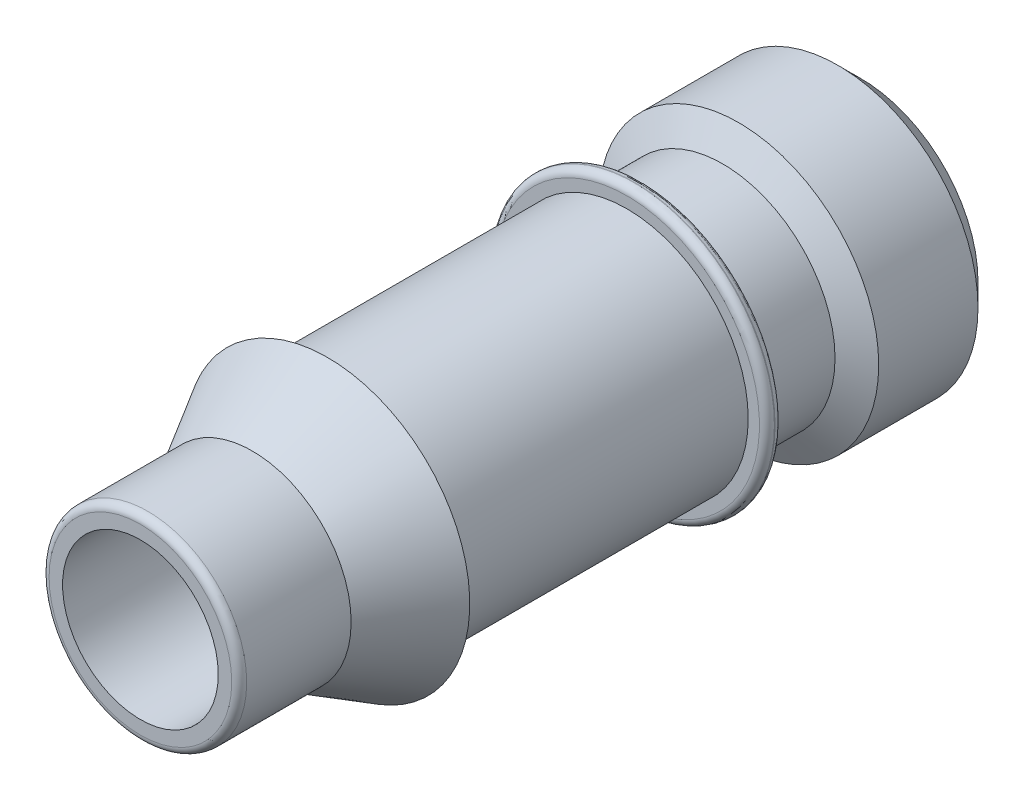
ISO-10303-21;
HEADER;
FILE_DESCRIPTION(('STEP AP214'),'2;1');
FILE_NAME('part.step','',(''),(''),'','','');
FILE_SCHEMA(('AUTOMOTIVE_DESIGN { 1 0 10303 214 1 1 1 1 }'));
ENDSEC;
DATA;
#1=APPLICATION_CONTEXT('core data for automotive mechanical design processes');
#2=APPLICATION_PROTOCOL_DEFINITION('international standard','automotive_design',2000,#1);
#3=PRODUCT_CONTEXT('',#1,'mechanical');
#4=PRODUCT('Part','Part','',(#3));
#5=PRODUCT_RELATED_PRODUCT_CATEGORY('part','',(#4));
#6=PRODUCT_DEFINITION_FORMATION('','',#4);
#7=PRODUCT_DEFINITION_CONTEXT('part definition',#1,'design');
#8=PRODUCT_DEFINITION('design','',#6,#7);
#9=PRODUCT_DEFINITION_SHAPE('','',#8);
#10=(LENGTH_UNIT() NAMED_UNIT(*) SI_UNIT(.MILLI.,.METRE.));
#11=(NAMED_UNIT(*) PLANE_ANGLE_UNIT() SI_UNIT($,.RADIAN.));
#12=(NAMED_UNIT(*) SI_UNIT($,.STERADIAN.) SOLID_ANGLE_UNIT());
#13=UNCERTAINTY_MEASURE_WITH_UNIT(LENGTH_MEASURE(1.E-05),#10,'distance_accuracy_value','');
#14=(GEOMETRIC_REPRESENTATION_CONTEXT(3) GLOBAL_UNCERTAINTY_ASSIGNED_CONTEXT((#13)) GLOBAL_UNIT_ASSIGNED_CONTEXT((#10,
#11,#12)) REPRESENTATION_CONTEXT('',''));
#15=CARTESIAN_POINT('',(0.,0.,0.));
#16=DIRECTION('',(0.,0.,1.));
#17=DIRECTION('',(1.,0.,0.));
#18=AXIS2_PLACEMENT_3D('',#15,#16,#17);
#19=CARTESIAN_POINT('',(0.,0.,-0.127000000000001));
#20=DIRECTION('',(0.,0.,-1.));
#21=DIRECTION('',(-1.,0.,0.));
#22=AXIS2_PLACEMENT_3D('',#19,#20,#21);
#23=TOROIDAL_SURFACE('',#22,2.2479,0.127);
#24=CARTESIAN_POINT('',(0.,0.,-0.127));
#25=DIRECTION('',(0.,0.,1.));
#26=DIRECTION('',(1.,0.,0.));
#27=AXIS2_PLACEMENT_3D('',#24,#25,#26);
#28=CIRCLE('',#27,2.3749);
#29=CARTESIAN_POINT('',(2.3749,0.,-0.127));
#30=VERTEX_POINT('',#29);
#31=EDGE_CURVE('E78',#30,#30,#28,.F.);
#32=ORIENTED_EDGE('',*,*,#31,.F.);
#33=EDGE_LOOP('',(#32));
#34=FACE_BOUND('',#33,.T.);
#35=CARTESIAN_POINT('',(0.,0.,0.));
#36=DIRECTION('',(0.,0.,-1.));
#37=DIRECTION('',(-1.,0.,0.));
#38=AXIS2_PLACEMENT_3D('',#35,#36,#37);
#39=CIRCLE('',#38,2.2479);
#40=CARTESIAN_POINT('',(-2.2479,0.,0.));
#41=VERTEX_POINT('',#40);
#42=EDGE_CURVE('E85',#41,#41,#39,.T.);
#43=ORIENTED_EDGE('',*,*,#42,.T.);
#44=EDGE_LOOP('',(#43));
#45=FACE_BOUND('',#44,.T.);
#46=ADVANCED_FACE('F14',(#34,#45),#23,.T.);
#47=CARTESIAN_POINT('',(0.,0.,-6.56847459613556));
#48=DIRECTION('',(0.,0.,1.));
#49=DIRECTION('',(1.,0.,0.));
#50=AXIS2_PLACEMENT_3D('',#47,#48,#49);
#51=CYLINDRICAL_SURFACE('',#50,2.3749);
#52=CARTESIAN_POINT('',(0.,0.,-0.137979624320711));
#53=DIRECTION('',(0.,0.,1.));
#54=DIRECTION('',(1.,0.,0.));
#55=AXIS2_PLACEMENT_3D('',#52,#53,#54);
#56=CIRCLE('',#55,2.3749);
#57=CARTESIAN_POINT('',(2.3749,0.,-0.137979624320711));
#58=VERTEX_POINT('',#57);
#59=EDGE_CURVE('E54',#58,#58,#56,.F.);
#60=ORIENTED_EDGE('',*,*,#59,.F.);
#61=EDGE_LOOP('',(#60));
#62=FACE_BOUND('',#61,.T.);
#63=ORIENTED_EDGE('',*,*,#31,.T.);
#64=EDGE_LOOP('',(#63));
#65=FACE_BOUND('',#64,.T.);
#66=ADVANCED_FACE('F71',(#62,#65),#51,.T.);
#67=CARTESIAN_POINT('',(0.,2.0574,0.));
#68=DIRECTION('',(0.,0.,-1.));
#69=DIRECTION('',(-1.,0.,0.));
#70=AXIS2_PLACEMENT_3D('',#67,#68,#69);
#71=PLANE('',#70);
#72=CARTESIAN_POINT('',(0.,0.,0.));
#73=DIRECTION('',(0.,0.,1.));
#74=DIRECTION('',(1.,0.,0.));
#75=AXIS2_PLACEMENT_3D('',#72,#73,#74);
#76=CIRCLE('',#75,2.0574);
#77=CARTESIAN_POINT('',(2.0574,0.,0.));
#78=VERTEX_POINT('',#77);
#79=EDGE_CURVE('E19',#78,#78,#76,.T.);
#80=ORIENTED_EDGE('',*,*,#79,.F.);
#81=EDGE_LOOP('',(#80));
#82=FACE_BOUND('',#81,.T.);
#83=ORIENTED_EDGE('',*,*,#42,.F.);
#84=EDGE_LOOP('',(#83));
#85=FACE_BOUND('',#84,.T.);
#86=ADVANCED_FACE('F66',(#82,#85),#71,.F.);
#87=CARTESIAN_POINT('',(0.,0.,-0.137979624320711));
#88=DIRECTION('',(0.,0.,1.));
#89=DIRECTION('',(1.,0.,0.));
#90=AXIS2_PLACEMENT_3D('',#87,#88,#89);
#91=TOROIDAL_SURFACE('',#90,2.2479,0.127);
#92=ORIENTED_EDGE('',*,*,#59,.T.);
#93=EDGE_LOOP('',(#92));
#94=FACE_BOUND('',#93,.T.);
#95=CARTESIAN_POINT('',(0.,0.,-0.247964850643712));
#96=DIRECTION('',(0.,0.,1.));
#97=DIRECTION('',(1.,0.,0.));
#98=AXIS2_PLACEMENT_3D('',#95,#96,#97);
#99=CIRCLE('',#98,2.31140000005325);
#100=CARTESIAN_POINT('',(2.31140000005325,0.,-0.247964850643712));
#101=VERTEX_POINT('',#100);
#102=EDGE_CURVE('E44',#101,#101,#99,.F.);
#103=ORIENTED_EDGE('',*,*,#102,.F.);
#104=EDGE_LOOP('',(#103));
#105=FACE_BOUND('',#104,.T.);
#106=ADVANCED_FACE('F61',(#94,#105),#91,.T.);
#107=CARTESIAN_POINT('',(0.,0.,-6.56847459613556));
#108=DIRECTION('',(0.,0.,1.));
#109=DIRECTION('',(1.,0.,0.));
#110=AXIS2_PLACEMENT_3D('',#107,#108,#109);
#111=CYLINDRICAL_SURFACE('',#110,2.0574);
#112=ORIENTED_EDGE('',*,*,#79,.T.);
#113=EDGE_LOOP('',(#112));
#114=FACE_BOUND('',#113,.T.);
#115=CARTESIAN_POINT('',(0.,0.,5.08));
#116=DIRECTION('',(0.,0.,1.));
#117=DIRECTION('',(1.,0.,0.));
#118=AXIS2_PLACEMENT_3D('',#115,#116,#117);
#119=CIRCLE('',#118,2.0574);
#120=CARTESIAN_POINT('',(2.0574,0.,5.08));
#121=VERTEX_POINT('',#120);
#122=EDGE_CURVE('E42',#121,#121,#119,.F.);
#123=ORIENTED_EDGE('',*,*,#122,.T.);
#124=EDGE_LOOP('',(#123));
#125=FACE_BOUND('',#124,.T.);
#126=ADVANCED_FACE('F65',(#114,#125),#111,.T.);
#127=CARTESIAN_POINT('',(0.,0.,-0.247964850700555));
#128=DIRECTION('',(0.,0.,1.));
#129=DIRECTION('',(1.,0.,0.));
#130=AXIS2_PLACEMENT_3D('',#127,#128,#129);
#131=CONICAL_SURFACE('',#130,2.31139999993957,1.04719755120686);
#132=ORIENTED_EDGE('',*,*,#102,.T.);
#133=EDGE_LOOP('',(#132));
#134=FACE_BOUND('',#133,.T.);
#135=CARTESIAN_POINT('',(0.,0.,-0.482600000000001));
#136=DIRECTION('',(0.,0.,1.));
#137=DIRECTION('',(1.,0.,0.));
#138=AXIS2_PLACEMENT_3D('',#135,#136,#137);
#139=CIRCLE('',#138,1.905);
#140=CARTESIAN_POINT('',(1.905,0.,-0.482600000000001));
#141=VERTEX_POINT('',#140);
#142=EDGE_CURVE('E41',#141,#141,#139,.F.);
#143=ORIENTED_EDGE('',*,*,#142,.F.);
#144=EDGE_LOOP('',(#143));
#145=FACE_BOUND('',#144,.T.);
#146=ADVANCED_FACE('F183',(#134,#145),#131,.T.);
#147=CARTESIAN_POINT('',(0.,2.413,5.08));
#148=DIRECTION('',(0.,0.,1.));
#149=DIRECTION('',(1.,0.,0.));
#150=AXIS2_PLACEMENT_3D('',#147,#148,#149);
#151=PLANE('',#150);
#152=ORIENTED_EDGE('',*,*,#122,.F.);
#153=EDGE_LOOP('',(#152));
#154=FACE_BOUND('',#153,.T.);
#155=CARTESIAN_POINT('',(0.,0.,5.079999999964));
#156=DIRECTION('',(0.,0.,-1.));
#157=DIRECTION('',(-1.,0.,0.));
#158=AXIS2_PLACEMENT_3D('',#155,#156,#157);
#159=CIRCLE('',#158,2.41300000004685);
#160=CARTESIAN_POINT('',(-2.41300000004685,0.,5.079999999964));
#161=VERTEX_POINT('',#160);
#162=EDGE_CURVE('E38',#161,#161,#159,.F.);
#163=ORIENTED_EDGE('',*,*,#162,.F.);
#164=EDGE_LOOP('',(#163));
#165=FACE_BOUND('',#164,.T.);
#166=ADVANCED_FACE('F178',(#154,#165),#151,.F.);
#167=CARTESIAN_POINT('',(0.,0.,-6.56847459613556));
#168=DIRECTION('',(0.,0.,1.));
#169=DIRECTION('',(1.,0.,0.));
#170=AXIS2_PLACEMENT_3D('',#167,#168,#169);
#171=CYLINDRICAL_SURFACE('',#170,1.905);
#172=CARTESIAN_POINT('',(0.,0.,-1.62560000001122));
#173=DIRECTION('',(0.,0.,-1.));
#174=DIRECTION('',(-1.,0.,0.));
#175=AXIS2_PLACEMENT_3D('',#172,#173,#174);
#176=CIRCLE('',#175,1.90499999996518);
#177=CARTESIAN_POINT('',(-1.90499999996518,0.,-1.62560000001122));
#178=VERTEX_POINT('',#177);
#179=EDGE_CURVE('E40',#178,#178,#176,.T.);
#180=ORIENTED_EDGE('',*,*,#179,.F.);
#181=EDGE_LOOP('',(#180));
#182=FACE_BOUND('',#181,.T.);
#183=ORIENTED_EDGE('',*,*,#142,.T.);
#184=EDGE_LOOP('',(#183));
#185=FACE_BOUND('',#184,.T.);
#186=ADVANCED_FACE('F169',(#182,#185),#171,.T.);
#187=CARTESIAN_POINT('',(0.,0.,5.079999999964));
#188=DIRECTION('',(0.,0.,-1.));
#189=DIRECTION('',(-1.,0.,0.));
#190=AXIS2_PLACEMENT_3D('',#187,#188,#189);
#191=CONICAL_SURFACE('',#190,2.41300000004685,0.523598775587264);
#192=ORIENTED_EDGE('',*,*,#162,.T.);
#193=EDGE_LOOP('',(#192));
#194=FACE_BOUND('',#193,.T.);
#195=CARTESIAN_POINT('',(0.,0.,6.35582862485524));
#196=DIRECTION('',(0.,0.,1.));
#197=DIRECTION('',(1.,0.,0.));
#198=AXIS2_PLACEMENT_3D('',#195,#196,#197);
#199=CIRCLE('',#198,1.6764);
#200=CARTESIAN_POINT('',(1.6764,0.,6.35582862485524));
#201=VERTEX_POINT('',#200);
#202=EDGE_CURVE('E158',#201,#201,#199,.T.);
#203=ORIENTED_EDGE('',*,*,#202,.F.);
#204=EDGE_LOOP('',(#203));
#205=FACE_BOUND('',#204,.T.);
#206=ADVANCED_FACE('F166',(#194,#205),#191,.T.);
#207=CARTESIAN_POINT('',(0.,0.,-1.89689689148054));
#208=DIRECTION('',(0.,0.,-1.));
#209=DIRECTION('',(0.,1.,0.));
#210=AXIS2_PLACEMENT_3D('',#207,#208,#209);
#211=CONICAL_SURFACE('',#210,2.37489999989293,1.04719755118058);
#212=CARTESIAN_POINT('',(0.,0.,-1.8968968914922));
#213=DIRECTION('',(0.,0.,1.));
#214=DIRECTION('',(1.,0.,0.));
#215=AXIS2_PLACEMENT_3D('',#212,#213,#214);
#216=CIRCLE('',#215,2.3749);
#217=CARTESIAN_POINT('',(2.3749,0.,-1.8968968914922));
#218=VERTEX_POINT('',#217);
#219=EDGE_CURVE('E155',#218,#218,#216,.F.);
#220=ORIENTED_EDGE('',*,*,#219,.F.);
#221=EDGE_LOOP('',(#220));
#222=FACE_BOUND('',#221,.T.);
#223=ORIENTED_EDGE('',*,*,#179,.T.);
#224=EDGE_LOOP('',(#223));
#225=FACE_BOUND('',#224,.T.);
#226=ADVANCED_FACE('F168',(#222,#225),#211,.T.);
#227=CARTESIAN_POINT('',(0.,0.,-6.56847459613556));
#228=DIRECTION('',(0.,0.,1.));
#229=DIRECTION('',(1.,0.,0.));
#230=AXIS2_PLACEMENT_3D('',#227,#228,#229);
#231=CYLINDRICAL_SURFACE('',#230,1.6764);
#232=ORIENTED_EDGE('',*,*,#202,.T.);
#233=EDGE_LOOP('',(#232));
#234=FACE_BOUND('',#233,.T.);
#235=CARTESIAN_POINT('',(0.,0.,8.128));
#236=DIRECTION('',(0.,0.,-1.));
#237=DIRECTION('',(-1.,0.,0.));
#238=AXIS2_PLACEMENT_3D('',#235,#236,#237);
#239=CIRCLE('',#238,1.6764);
#240=CARTESIAN_POINT('',(-1.6764,0.,8.128));
#241=VERTEX_POINT('',#240);
#242=EDGE_CURVE('E133',#241,#241,#239,.F.);
#243=ORIENTED_EDGE('',*,*,#242,.F.);
#244=EDGE_LOOP('',(#243));
#245=FACE_BOUND('',#244,.T.);
#246=ADVANCED_FACE('F163',(#234,#245),#231,.T.);
#247=CARTESIAN_POINT('',(0.,0.,-6.56847459613556));
#248=DIRECTION('',(0.,0.,1.));
#249=DIRECTION('',(1.,0.,0.));
#250=AXIS2_PLACEMENT_3D('',#247,#248,#249);
#251=CYLINDRICAL_SURFACE('',#250,2.3749);
#252=CARTESIAN_POINT('',(0.,0.,-3.58140000003004));
#253=DIRECTION('',(0.,0.,1.));
#254=DIRECTION('',(1.,0.,0.));
#255=AXIS2_PLACEMENT_3D('',#252,#253,#254);
#256=CIRCLE('',#255,2.37489999994978);
#257=CARTESIAN_POINT('',(2.37489999994978,0.,-3.58140000003004));
#258=VERTEX_POINT('',#257);
#259=EDGE_CURVE('E147',#258,#258,#256,.F.);
#260=ORIENTED_EDGE('',*,*,#259,.F.);
#261=EDGE_LOOP('',(#260));
#262=FACE_BOUND('',#261,.T.);
#263=ORIENTED_EDGE('',*,*,#219,.T.);
#264=EDGE_LOOP('',(#263));
#265=FACE_BOUND('',#264,.T.);
#266=ADVANCED_FACE('F139',(#262,#265),#251,.T.);
#267=CARTESIAN_POINT('',(0.,0.,8.128));
#268=DIRECTION('',(0.,0.,-1.));
#269=DIRECTION('',(-1.,0.,0.));
#270=AXIS2_PLACEMENT_3D('',#267,#268,#269);
#271=TOROIDAL_SURFACE('',#270,1.5494,0.127);
#272=ORIENTED_EDGE('',*,*,#242,.T.);
#273=EDGE_LOOP('',(#272));
#274=FACE_BOUND('',#273,.T.);
#275=CARTESIAN_POINT('',(0.,0.,8.255));
#276=DIRECTION('',(0.,0.,-1.));
#277=DIRECTION('',(-1.,0.,0.));
#278=AXIS2_PLACEMENT_3D('',#275,#276,#277);
#279=CIRCLE('',#278,1.5494);
#280=CARTESIAN_POINT('',(-1.5494,0.,8.255));
#281=VERTEX_POINT('',#280);
#282=EDGE_CURVE('E37',#281,#281,#279,.T.);
#283=ORIENTED_EDGE('',*,*,#282,.T.);
#284=EDGE_LOOP('',(#283));
#285=FACE_BOUND('',#284,.T.);
#286=ADVANCED_FACE('F135',(#274,#285),#271,.T.);
#287=CARTESIAN_POINT('',(0.,0.,-3.58140000003004));
#288=DIRECTION('',(0.,0.,1.));
#289=DIRECTION('',(1.,0.,0.));
#290=AXIS2_PLACEMENT_3D('',#287,#288,#289);
#291=CONICAL_SURFACE('',#290,2.37489999994978,0.785398163397448);
#292=ORIENTED_EDGE('',*,*,#259,.T.);
#293=EDGE_LOOP('',(#292));
#294=FACE_BOUND('',#293,.T.);
#295=CARTESIAN_POINT('',(0.,0.,-3.96239999997761));
#296=DIRECTION('',(0.,0.,1.));
#297=DIRECTION('',(1.,0.,0.));
#298=AXIS2_PLACEMENT_3D('',#295,#296,#297);
#299=CIRCLE('',#298,1.99390000000221);
#300=CARTESIAN_POINT('',(1.99390000000221,0.,-3.96239999997761));
#301=VERTEX_POINT('',#300);
#302=EDGE_CURVE('E28',#301,#301,#299,.T.);
#303=ORIENTED_EDGE('',*,*,#302,.T.);
#304=EDGE_LOOP('',(#303));
#305=FACE_BOUND('',#304,.T.);
#306=ADVANCED_FACE('F117',(#294,#305),#291,.T.);
#307=CARTESIAN_POINT('',(0.,0.,8.255));
#308=DIRECTION('',(0.,0.,-1.));
#309=DIRECTION('',(-1.,0.,0.));
#310=AXIS2_PLACEMENT_3D('',#307,#308,#309);
#311=PLANE('',#310);
#312=CARTESIAN_POINT('',(0.,0.,8.255));
#313=DIRECTION('',(0.,0.,1.));
#314=DIRECTION('',(1.,0.,0.));
#315=AXIS2_PLACEMENT_3D('',#312,#313,#314);
#316=CIRCLE('',#315,1.32079999999999);
#317=CARTESIAN_POINT('',(1.32079999999999,0.,8.255));
#318=VERTEX_POINT('',#317);
#319=EDGE_CURVE('E23',#318,#318,#316,.F.);
#320=ORIENTED_EDGE('',*,*,#319,.T.);
#321=EDGE_LOOP('',(#320));
#322=FACE_BOUND('',#321,.T.);
#323=ORIENTED_EDGE('',*,*,#282,.F.);
#324=EDGE_LOOP('',(#323));
#325=FACE_BOUND('',#324,.T.);
#326=ADVANCED_FACE('F110',(#322,#325),#311,.F.);
#327=CARTESIAN_POINT('',(0.,2.3749,-3.9624));
#328=DIRECTION('',(0.,0.,1.));
#329=DIRECTION('',(1.,0.,0.));
#330=AXIS2_PLACEMENT_3D('',#327,#328,#329);
#331=PLANE('',#330);
#332=CARTESIAN_POINT('',(0.,0.,-3.9624));
#333=DIRECTION('',(0.,0.,1.));
#334=DIRECTION('',(1.,0.,0.));
#335=AXIS2_PLACEMENT_3D('',#332,#333,#334);
#336=CIRCLE('',#335,1.32079999999999);
#337=CARTESIAN_POINT('',(1.32079999999999,0.,-3.9624));
#338=VERTEX_POINT('',#337);
#339=EDGE_CURVE('E10',#338,#338,#336,.T.);
#340=ORIENTED_EDGE('',*,*,#339,.T.);
#341=EDGE_LOOP('',(#340));
#342=FACE_BOUND('',#341,.T.);
#343=ORIENTED_EDGE('',*,*,#302,.F.);
#344=EDGE_LOOP('',(#343));
#345=FACE_BOUND('',#344,.T.);
#346=ADVANCED_FACE('F104',(#342,#345),#331,.F.);
#347=CARTESIAN_POINT('',(0.,0.,-3.9624));
#348=DIRECTION('',(0.,0.,1.));
#349=DIRECTION('',(1.,0.,0.));
#350=AXIS2_PLACEMENT_3D('',#347,#348,#349);
#351=CYLINDRICAL_SURFACE('',#350,1.32079999999999);
#352=ORIENTED_EDGE('',*,*,#339,.F.);
#353=EDGE_LOOP('',(#352));
#354=FACE_BOUND('',#353,.T.);
#355=ORIENTED_EDGE('',*,*,#319,.F.);
#356=EDGE_LOOP('',(#355));
#357=FACE_BOUND('',#356,.T.);
#358=ADVANCED_FACE('F102',(#354,#357),#351,.F.);
#359=CLOSED_SHELL('',(#46,#66,#86,#106,#126,#146,#166,#186,#206,#226,#246,#266,#286,#306,#326,
#346,#358));
#360=MANIFOLD_SOLID_BREP('B1',#359);
#361=ADVANCED_BREP_SHAPE_REPRESENTATION('',(#18,#360),#14);
#362=SHAPE_DEFINITION_REPRESENTATION(#9,#361);
ENDSEC;
END-ISO-10303-21;
